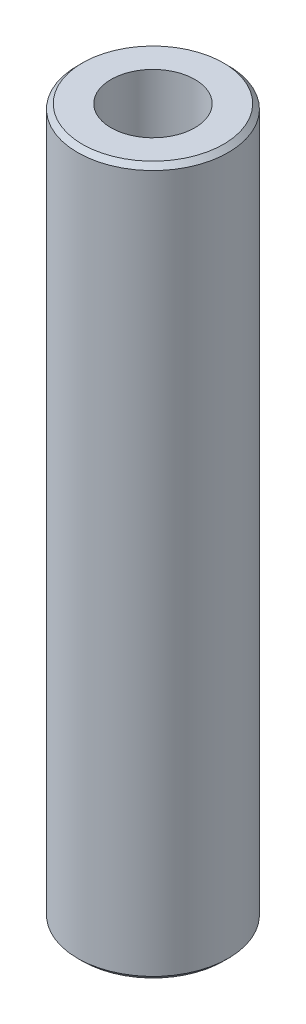
ISO-10303-21;
HEADER;
FILE_DESCRIPTION(('STEP AP214'),'2;1');
FILE_NAME('part.step','',(''),(''),'','','');
FILE_SCHEMA(('AUTOMOTIVE_DESIGN { 1 0 10303 214 1 1 1 1 }'));
ENDSEC;
DATA;
#1=APPLICATION_CONTEXT('core data for automotive mechanical design processes');
#2=APPLICATION_PROTOCOL_DEFINITION('international standard','automotive_design',2000,#1);
#3=PRODUCT_CONTEXT('',#1,'mechanical');
#4=PRODUCT('Part','Part','',(#3));
#5=PRODUCT_RELATED_PRODUCT_CATEGORY('part','',(#4));
#6=PRODUCT_DEFINITION_FORMATION('','',#4);
#7=PRODUCT_DEFINITION_CONTEXT('part definition',#1,'design');
#8=PRODUCT_DEFINITION('design','',#6,#7);
#9=PRODUCT_DEFINITION_SHAPE('','',#8);
#10=(LENGTH_UNIT() NAMED_UNIT(*) SI_UNIT(.MILLI.,.METRE.));
#11=(NAMED_UNIT(*) PLANE_ANGLE_UNIT() SI_UNIT($,.RADIAN.));
#12=(NAMED_UNIT(*) SI_UNIT($,.STERADIAN.) SOLID_ANGLE_UNIT());
#13=UNCERTAINTY_MEASURE_WITH_UNIT(LENGTH_MEASURE(1.E-05),#10,'distance_accuracy_value','');
#14=(GEOMETRIC_REPRESENTATION_CONTEXT(3) GLOBAL_UNCERTAINTY_ASSIGNED_CONTEXT((#13)) GLOBAL_UNIT_ASSIGNED_CONTEXT((#10,
#11,#12)) REPRESENTATION_CONTEXT('',''));
#15=CARTESIAN_POINT('',(0.,0.,0.));
#16=DIRECTION('',(0.,0.,1.));
#17=DIRECTION('',(1.,0.,0.));
#18=AXIS2_PLACEMENT_3D('',#15,#16,#17);
#19=CARTESIAN_POINT('',(0.,399.180378399586,0.));
#20=DIRECTION('',(0.,-1.,0.));
#21=DIRECTION('',(0.,0.,-1.));
#22=AXIS2_PLACEMENT_3D('',#19,#20,#21);
#23=CYLINDRICAL_SURFACE('',#22,42.5);
#24=CARTESIAN_POINT('',(0.,396.48954739586,0.));
#25=DIRECTION('',(0.,1.,0.));
#26=DIRECTION('',(0.,0.,1.));
#27=AXIS2_PLACEMENT_3D('',#24,#25,#26);
#28=CIRCLE('',#27,42.5);
#29=CARTESIAN_POINT('',(0.,396.48954739586,42.5));
#30=VERTEX_POINT('',#29);
#31=EDGE_CURVE('E50',#30,#30,#28,.F.);
#32=ORIENTED_EDGE('',*,*,#31,.T.);
#33=EDGE_LOOP('',(#32));
#34=FACE_BOUND('',#33,.T.);
#35=CARTESIAN_POINT('',(0.,2.69083100372541,0.));
#36=DIRECTION('',(0.,1.,0.));
#37=DIRECTION('',(0.,0.,1.));
#38=AXIS2_PLACEMENT_3D('',#35,#36,#37);
#39=CIRCLE('',#38,42.5);
#40=CARTESIAN_POINT('',(0.,2.69083100372541,42.5));
#41=VERTEX_POINT('',#40);
#42=EDGE_CURVE('E51',#41,#41,#39,.T.);
#43=ORIENTED_EDGE('',*,*,#42,.T.);
#44=EDGE_LOOP('',(#43));
#45=FACE_BOUND('',#44,.T.);
#46=ADVANCED_FACE('F39',(#34,#45),#23,.T.);
#47=CARTESIAN_POINT('',(0.,399.180378399586,0.));
#48=DIRECTION('',(0.,1.,0.));
#49=DIRECTION('',(0.,0.,1.));
#50=AXIS2_PLACEMENT_3D('',#47,#48,#49);
#51=PLANE('',#50);
#52=CARTESIAN_POINT('',(0.,399.180378399586,0.));
#53=DIRECTION('',(0.,1.,0.));
#54=DIRECTION('',(0.,0.,1.));
#55=AXIS2_PLACEMENT_3D('',#52,#53,#54);
#56=CIRCLE('',#55,39.8091689962745);
#57=CARTESIAN_POINT('',(0.,399.180378399586,39.8091689962745));
#58=VERTEX_POINT('',#57);
#59=EDGE_CURVE('E54',#58,#58,#56,.T.);
#60=ORIENTED_EDGE('',*,*,#59,.T.);
#61=EDGE_LOOP('',(#60));
#62=FACE_BOUND('',#61,.T.);
#63=CARTESIAN_POINT('',(0.,399.180378399586,0.));
#64=DIRECTION('',(0.,1.,0.));
#65=DIRECTION('',(0.,0.,1.));
#66=AXIS2_PLACEMENT_3D('',#63,#64,#65);
#67=CIRCLE('',#66,23.6495323314738);
#68=CARTESIAN_POINT('',(0.,399.180378399586,23.6495323314738));
#69=VERTEX_POINT('',#68);
#70=EDGE_CURVE('E58',#69,#69,#67,.T.);
#71=ORIENTED_EDGE('',*,*,#70,.F.);
#72=EDGE_LOOP('',(#71));
#73=FACE_BOUND('',#72,.T.);
#74=ADVANCED_FACE('F69',(#62,#73),#51,.T.);
#75=CARTESIAN_POINT('',(0.,0.,0.));
#76=DIRECTION('',(0.,1.,0.));
#77=DIRECTION('',(0.,0.,1.));
#78=AXIS2_PLACEMENT_3D('',#75,#76,#77);
#79=PLANE('',#78);
#80=CARTESIAN_POINT('',(0.,0.,0.));
#81=DIRECTION('',(0.,1.,0.));
#82=DIRECTION('',(0.,0.,1.));
#83=AXIS2_PLACEMENT_3D('',#80,#81,#82);
#84=CIRCLE('',#83,39.8091689962746);
#85=CARTESIAN_POINT('',(0.,0.,39.8091689962746));
#86=VERTEX_POINT('',#85);
#87=EDGE_CURVE('E10',#86,#86,#84,.F.);
#88=ORIENTED_EDGE('',*,*,#87,.T.);
#89=EDGE_LOOP('',(#88));
#90=FACE_BOUND('',#89,.T.);
#91=CARTESIAN_POINT('',(0.,0.,0.));
#92=DIRECTION('',(0.,1.,0.));
#93=DIRECTION('',(0.,0.,1.));
#94=AXIS2_PLACEMENT_3D('',#91,#92,#93);
#95=CIRCLE('',#94,23.6495323314738);
#96=CARTESIAN_POINT('',(0.,0.,23.6495323314738));
#97=VERTEX_POINT('',#96);
#98=EDGE_CURVE('E63',#97,#97,#95,.T.);
#99=ORIENTED_EDGE('',*,*,#98,.T.);
#100=EDGE_LOOP('',(#99));
#101=FACE_BOUND('',#100,.T.);
#102=ADVANCED_FACE('F75',(#90,#101),#79,.F.);
#103=CARTESIAN_POINT('',(0.,399.180378399586,0.));
#104=DIRECTION('',(0.,-1.,0.));
#105=DIRECTION('',(0.,0.,-1.));
#106=AXIS2_PLACEMENT_3D('',#103,#104,#105);
#107=CYLINDRICAL_SURFACE('',#106,23.6495323314738);
#108=ORIENTED_EDGE('',*,*,#70,.T.);
#109=EDGE_LOOP('',(#108));
#110=FACE_BOUND('',#109,.T.);
#111=ORIENTED_EDGE('',*,*,#98,.F.);
#112=EDGE_LOOP('',(#111));
#113=FACE_BOUND('',#112,.T.);
#114=ADVANCED_FACE('F70',(#110,#113),#107,.F.);
#115=CARTESIAN_POINT('',(0.,399.180378399586,0.));
#116=DIRECTION('',(0.,-1.,0.));
#117=DIRECTION('',(0.,0.,-1.));
#118=AXIS2_PLACEMENT_3D('',#115,#116,#117);
#119=CONICAL_SURFACE('',#118,39.8091689962745,0.785398163397443);
#120=ORIENTED_EDGE('',*,*,#31,.F.);
#121=EDGE_LOOP('',(#120));
#122=FACE_BOUND('',#121,.T.);
#123=ORIENTED_EDGE('',*,*,#59,.F.);
#124=EDGE_LOOP('',(#123));
#125=FACE_BOUND('',#124,.T.);
#126=ADVANCED_FACE('F81',(#122,#125),#119,.T.);
#127=CARTESIAN_POINT('',(0.,2.69083100372541,0.));
#128=DIRECTION('',(0.,1.,0.));
#129=DIRECTION('',(0.,0.,1.));
#130=AXIS2_PLACEMENT_3D('',#127,#128,#129);
#131=CONICAL_SURFACE('',#130,42.5,0.785398163397443);
#132=ORIENTED_EDGE('',*,*,#87,.F.);
#133=EDGE_LOOP('',(#132));
#134=FACE_BOUND('',#133,.T.);
#135=ORIENTED_EDGE('',*,*,#42,.F.);
#136=EDGE_LOOP('',(#135));
#137=FACE_BOUND('',#136,.T.);
#138=ADVANCED_FACE('F45',(#134,#137),#131,.T.);
#139=CLOSED_SHELL('',(#46,#74,#102,#114,#126,#138));
#140=MANIFOLD_SOLID_BREP('B2',#139);
#141=ADVANCED_BREP_SHAPE_REPRESENTATION('',(#18,#140),#14);
#142=SHAPE_DEFINITION_REPRESENTATION(#9,#141);
ENDSEC;
END-ISO-10303-21;
